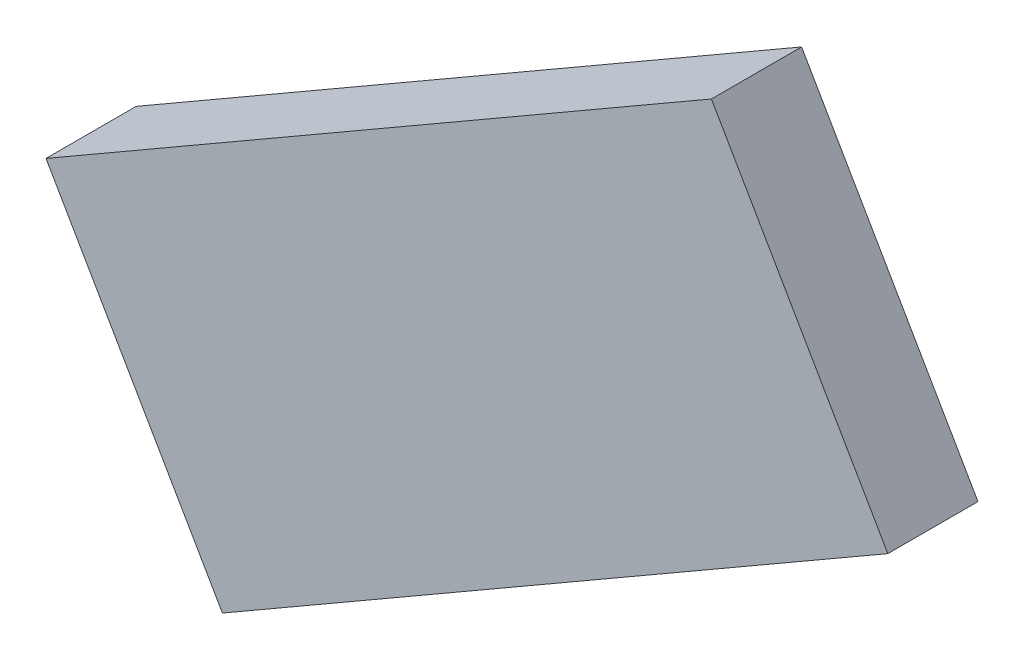
ISO-10303-21;
HEADER;
FILE_DESCRIPTION(('STEP AP214'),'2;1');
FILE_NAME('part.step','',(''),(''),'','','');
FILE_SCHEMA(('AUTOMOTIVE_DESIGN { 1 0 10303 214 1 1 1 1 }'));
ENDSEC;
DATA;
#1=APPLICATION_CONTEXT('core data for automotive mechanical design processes');
#2=APPLICATION_PROTOCOL_DEFINITION('international standard','automotive_design',2000,#1);
#3=PRODUCT_CONTEXT('',#1,'mechanical');
#4=PRODUCT('Part','Part','',(#3));
#5=PRODUCT_RELATED_PRODUCT_CATEGORY('part','',(#4));
#6=PRODUCT_DEFINITION_FORMATION('','',#4);
#7=PRODUCT_DEFINITION_CONTEXT('part definition',#1,'design');
#8=PRODUCT_DEFINITION('design','',#6,#7);
#9=PRODUCT_DEFINITION_SHAPE('','',#8);
#10=(LENGTH_UNIT() NAMED_UNIT(*) SI_UNIT(.MILLI.,.METRE.));
#11=(NAMED_UNIT(*) PLANE_ANGLE_UNIT() SI_UNIT($,.RADIAN.));
#12=(NAMED_UNIT(*) SI_UNIT($,.STERADIAN.) SOLID_ANGLE_UNIT());
#13=UNCERTAINTY_MEASURE_WITH_UNIT(LENGTH_MEASURE(1.E-05),#10,'distance_accuracy_value','');
#14=(GEOMETRIC_REPRESENTATION_CONTEXT(3) GLOBAL_UNCERTAINTY_ASSIGNED_CONTEXT((#13)) GLOBAL_UNIT_ASSIGNED_CONTEXT((#10,
#11,#12)) REPRESENTATION_CONTEXT('',''));
#15=CARTESIAN_POINT('',(0.,0.,0.));
#16=DIRECTION('',(0.,0.,1.));
#17=DIRECTION('',(1.,0.,0.));
#18=AXIS2_PLACEMENT_3D('',#15,#16,#17);
#19=CARTESIAN_POINT('',(3.1185231,4.39856118,1.15000024));
#20=DIRECTION('',(0.,0.,-1.));
#21=DIRECTION('',(-1.,0.,0.));
#22=AXIS2_PLACEMENT_3D('',#19,#20,#21);
#23=PLANE('',#22);
#24=DIRECTION('',(-0.500000090607198,0.866025351472342,0.));
#25=VECTOR('',#24,1.);
#26=CARTESIAN_POINT('',(-5.36852368,-0.50144426,1.15000024));
#27=LINE('',#26,#25);
#28=CARTESIAN_POINT('',(-5.36852367999986,-0.501444260000241,1.15000024));
#29=VERTEX_POINT('',#28);
#30=CARTESIAN_POINT('',(-3.11852310000019,-4.39855864000011,1.15000024));
#31=VERTEX_POINT('',#30);
#32=EDGE_CURVE('E55',#29,#31,#27,.F.);
#33=ORIENTED_EDGE('',*,*,#32,.T.);
#34=DIRECTION('',(-0.866025397135755,-0.500000011515858,0.));
#35=VECTOR('',#34,1.);
#36=CARTESIAN_POINT('',(-3.1185231,-4.39855864,1.15000024));
#37=LINE('',#36,#35);
#38=CARTESIAN_POINT('',(5.36852621999984,0.501441720000285,1.15000024));
#39=VERTEX_POINT('',#38);
#40=EDGE_CURVE('E57',#31,#39,#37,.F.);
#41=ORIENTED_EDGE('',*,*,#40,.T.);
#42=DIRECTION('',(0.500000025117057,-0.866025389283099,0.));
#43=VECTOR('',#42,1.);
#44=CARTESIAN_POINT('',(5.36852622,0.50144172,1.15000024));
#45=LINE('',#44,#43);
#46=CARTESIAN_POINT('',(3.11852310000087,4.3985611800005,1.15000024));
#47=VERTEX_POINT('',#46);
#48=EDGE_CURVE('E20',#39,#47,#45,.F.);
#49=ORIENTED_EDGE('',*,*,#48,.T.);
#50=DIRECTION('',(0.866025107880074,0.500000512521043,0.));
#51=VECTOR('',#50,1.);
#52=CARTESIAN_POINT('',(3.1185231,4.39856118,1.15000024));
#53=LINE('',#52,#51);
#54=EDGE_CURVE('E80',#47,#29,#53,.F.);
#55=ORIENTED_EDGE('',*,*,#54,.T.);
#56=EDGE_LOOP('',(#33,#41,#49,#55));
#57=FACE_BOUND('',#56,.T.);
#58=ADVANCED_FACE('F17',(#57),#23,.F.);
#59=CARTESIAN_POINT('',(5.36852622,0.50144172,0.));
#60=DIRECTION('',(-0.866025389283099,-0.500000025117057,0.));
#61=DIRECTION('',(0.500000025117057,-0.866025389283099,0.));
#62=AXIS2_PLACEMENT_3D('',#59,#60,#61);
#63=PLANE('',#62);
#64=DIRECTION('',(0.,0.,1.));
#65=VECTOR('',#64,1.);
#66=CARTESIAN_POINT('',(3.1185231,4.39856118,0.));
#67=LINE('',#66,#65);
#68=CARTESIAN_POINT('',(3.11852310000087,4.3985611800005,0.));
#69=VERTEX_POINT('',#68);
#70=EDGE_CURVE('E68',#69,#47,#67,.T.);
#71=ORIENTED_EDGE('',*,*,#70,.T.);
#72=ORIENTED_EDGE('',*,*,#48,.F.);
#73=DIRECTION('',(0.,0.,1.));
#74=VECTOR('',#73,1.);
#75=CARTESIAN_POINT('',(5.36852621999934,0.501441720001141,0.));
#76=LINE('',#75,#74);
#77=CARTESIAN_POINT('',(5.36852621999984,0.501441720000285,0.));
#78=VERTEX_POINT('',#77);
#79=EDGE_CURVE('E63',#39,#78,#76,.F.);
#80=ORIENTED_EDGE('',*,*,#79,.T.);
#81=DIRECTION('',(0.500000025117445,-0.866025389282875,0.));
#82=VECTOR('',#81,1.);
#83=CARTESIAN_POINT('',(3.1185231,4.39856118,0.));
#84=LINE('',#83,#82);
#85=EDGE_CURVE('E83',#69,#78,#84,.T.);
#86=ORIENTED_EDGE('',*,*,#85,.F.);
#87=EDGE_LOOP('',(#71,#72,#80,#86));
#88=FACE_BOUND('',#87,.T.);
#89=ADVANCED_FACE('F65',(#88),#63,.F.);
#90=CARTESIAN_POINT('',(-3.1185231,-4.39855864,0.));
#91=DIRECTION('',(-0.500000011515858,0.866025397135755,0.));
#92=DIRECTION('',(-0.866025397135755,-0.500000011515858,0.));
#93=AXIS2_PLACEMENT_3D('',#90,#91,#92);
#94=PLANE('',#93);
#95=ORIENTED_EDGE('',*,*,#79,.F.);
#96=ORIENTED_EDGE('',*,*,#40,.F.);
#97=DIRECTION('',(0.,0.,1.));
#98=VECTOR('',#97,1.);
#99=CARTESIAN_POINT('',(-3.11852310000074,-4.39855864000043,0.));
#100=LINE('',#99,#98);
#101=CARTESIAN_POINT('',(-3.11852310000019,-4.39855864000011,0.));
#102=VERTEX_POINT('',#101);
#103=EDGE_CURVE('E75',#31,#102,#100,.F.);
#104=ORIENTED_EDGE('',*,*,#103,.T.);
#105=DIRECTION('',(-0.866025397135822,-0.500000011515742,0.));
#106=VECTOR('',#105,1.);
#107=CARTESIAN_POINT('',(5.36852622,0.50144172,0.));
#108=LINE('',#107,#106);
#109=EDGE_CURVE('E72',#78,#102,#108,.T.);
#110=ORIENTED_EDGE('',*,*,#109,.F.);
#111=EDGE_LOOP('',(#95,#96,#104,#110));
#112=FACE_BOUND('',#111,.T.);
#113=ADVANCED_FACE('F70',(#112),#94,.F.);
#114=CARTESIAN_POINT('',(-5.36852368,-0.50144426,0.));
#115=DIRECTION('',(0.866025351472342,0.500000090607198,0.));
#116=DIRECTION('',(-0.500000090607198,0.866025351472342,0.));
#117=AXIS2_PLACEMENT_3D('',#114,#115,#116);
#118=PLANE('',#117);
#119=ORIENTED_EDGE('',*,*,#103,.F.);
#120=ORIENTED_EDGE('',*,*,#32,.F.);
#121=DIRECTION('',(0.,0.,1.));
#122=VECTOR('',#121,1.);
#123=CARTESIAN_POINT('',(-5.36852367999944,-0.501444260000966,0.));
#124=LINE('',#123,#122);
#125=CARTESIAN_POINT('',(-5.36852367999986,-0.501444260000241,0.));
#126=VERTEX_POINT('',#125);
#127=EDGE_CURVE('E35',#29,#126,#124,.F.);
#128=ORIENTED_EDGE('',*,*,#127,.T.);
#129=DIRECTION('',(-0.500000090607363,0.866025351472247,0.));
#130=VECTOR('',#129,1.);
#131=CARTESIAN_POINT('',(-3.1185231,-4.39855864,0.));
#132=LINE('',#131,#130);
#133=EDGE_CURVE('E26',#102,#126,#132,.T.);
#134=ORIENTED_EDGE('',*,*,#133,.F.);
#135=EDGE_LOOP('',(#119,#120,#128,#134));
#136=FACE_BOUND('',#135,.T.);
#137=ADVANCED_FACE('F89',(#136),#118,.F.);
#138=CARTESIAN_POINT('',(3.1185231,4.39856118,0.));
#139=DIRECTION('',(0.500000512521043,-0.866025107880074,0.));
#140=DIRECTION('',(0.866025107880074,0.500000512521043,0.));
#141=AXIS2_PLACEMENT_3D('',#138,#139,#140);
#142=PLANE('',#141);
#143=ORIENTED_EDGE('',*,*,#127,.F.);
#144=ORIENTED_EDGE('',*,*,#54,.F.);
#145=ORIENTED_EDGE('',*,*,#70,.F.);
#146=DIRECTION('',(0.866025107880131,0.500000512520944,0.));
#147=VECTOR('',#146,1.);
#148=CARTESIAN_POINT('',(-5.36852368,-0.50144426,0.));
#149=LINE('',#148,#147);
#150=EDGE_CURVE('E11',#126,#69,#149,.T.);
#151=ORIENTED_EDGE('',*,*,#150,.F.);
#152=EDGE_LOOP('',(#143,#144,#145,#151));
#153=FACE_BOUND('',#152,.T.);
#154=ADVANCED_FACE('F91',(#153),#142,.F.);
#155=CARTESIAN_POINT('',(3.1185231,4.39856118,0.));
#156=DIRECTION('',(0.,0.,-1.));
#157=DIRECTION('',(-1.,0.,0.));
#158=AXIS2_PLACEMENT_3D('',#155,#156,#157);
#159=PLANE('',#158);
#160=ORIENTED_EDGE('',*,*,#133,.T.);
#161=ORIENTED_EDGE('',*,*,#150,.T.);
#162=ORIENTED_EDGE('',*,*,#85,.T.);
#163=ORIENTED_EDGE('',*,*,#109,.T.);
#164=EDGE_LOOP('',(#160,#161,#162,#163));
#165=FACE_BOUND('',#164,.T.);
#166=ADVANCED_FACE('F88',(#165),#159,.T.);
#167=CLOSED_SHELL('',(#58,#89,#113,#137,#154,#166));
#168=MANIFOLD_SOLID_BREP('B1',#167);
#169=ADVANCED_BREP_SHAPE_REPRESENTATION('',(#18,#168),#14);
#170=SHAPE_DEFINITION_REPRESENTATION(#9,#169);
ENDSEC;
END-ISO-10303-21;
